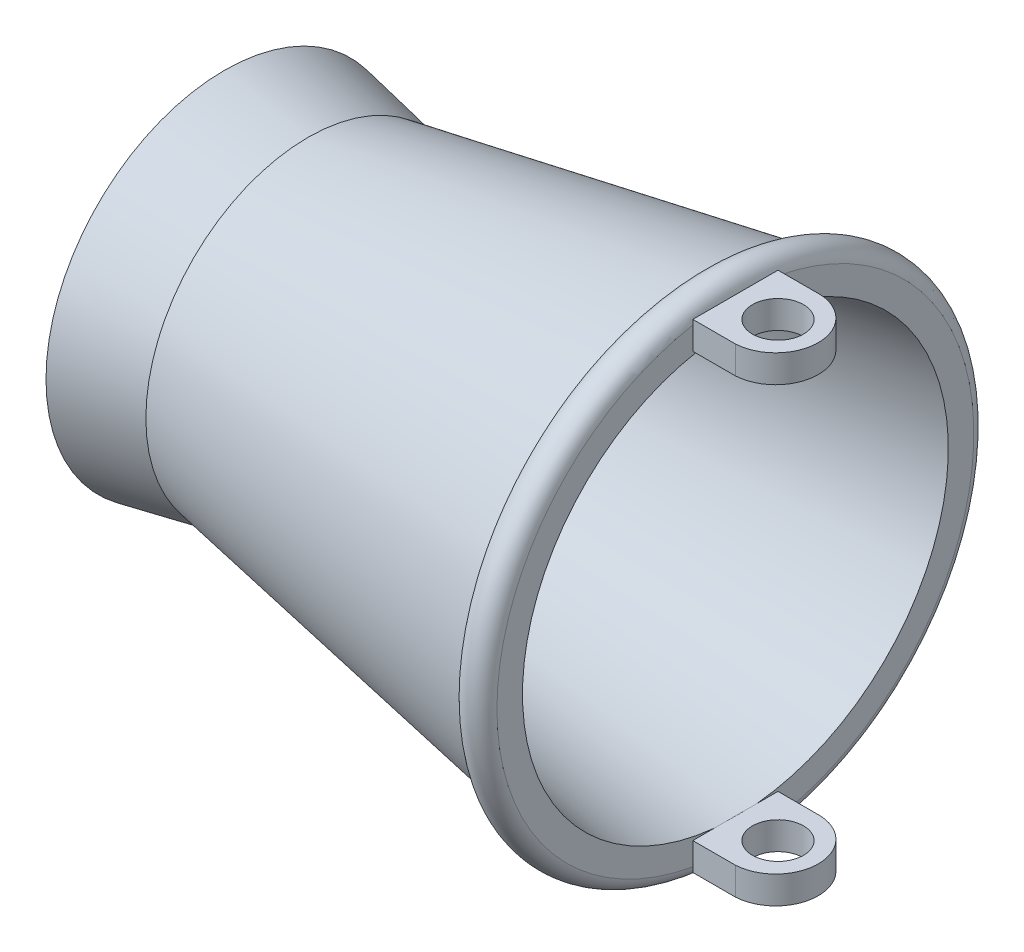
ISO-10303-21;
HEADER;
FILE_DESCRIPTION(('STEP AP214'),'2;1');
FILE_NAME('part.step','',(''),(''),'','','');
FILE_SCHEMA(('AUTOMOTIVE_DESIGN { 1 0 10303 214 1 1 1 1 }'));
ENDSEC;
DATA;
#1=APPLICATION_CONTEXT('core data for automotive mechanical design processes');
#2=APPLICATION_PROTOCOL_DEFINITION('international standard','automotive_design',2000,#1);
#3=PRODUCT_CONTEXT('',#1,'mechanical');
#4=PRODUCT('Part','Part','',(#3));
#5=PRODUCT_RELATED_PRODUCT_CATEGORY('part','',(#4));
#6=PRODUCT_DEFINITION_FORMATION('','',#4);
#7=PRODUCT_DEFINITION_CONTEXT('part definition',#1,'design');
#8=PRODUCT_DEFINITION('design','',#6,#7);
#9=PRODUCT_DEFINITION_SHAPE('','',#8);
#10=(LENGTH_UNIT() NAMED_UNIT(*) SI_UNIT(.MILLI.,.METRE.));
#11=(NAMED_UNIT(*) PLANE_ANGLE_UNIT() SI_UNIT($,.RADIAN.));
#12=(NAMED_UNIT(*) SI_UNIT($,.STERADIAN.) SOLID_ANGLE_UNIT());
#13=UNCERTAINTY_MEASURE_WITH_UNIT(LENGTH_MEASURE(1.E-05),#10,'distance_accuracy_value','');
#14=(GEOMETRIC_REPRESENTATION_CONTEXT(3) GLOBAL_UNCERTAINTY_ASSIGNED_CONTEXT((#13)) GLOBAL_UNIT_ASSIGNED_CONTEXT((#10,
#11,#12)) REPRESENTATION_CONTEXT('',''));
#15=CARTESIAN_POINT('',(0.,0.,0.));
#16=DIRECTION('',(0.,0.,1.));
#17=DIRECTION('',(1.,0.,0.));
#18=AXIS2_PLACEMENT_3D('',#15,#16,#17);
#19=CARTESIAN_POINT('',(31.3496597971443,-14.0617621186695,2.50000000000001));
#20=DIRECTION('',(0.,0.,-1.));
#21=DIRECTION('',(-1.,0.,0.));
#22=AXIS2_PLACEMENT_3D('',#19,#20,#21);
#23=PLANE('',#22);
#24=DIRECTION('',(0.,-1.,0.));
#25=VECTOR('',#24,1.);
#26=CARTESIAN_POINT('',(28.8496597971443,18.0286817919166,2.5));
#27=LINE('',#26,#25);
#28=CARTESIAN_POINT('',(28.8496597971443,-12.4385118481672,2.5));
#29=VERTEX_POINT('',#28);
#30=CARTESIAN_POINT('',(28.8496597971443,-14.0617621186695,2.5));
#31=VERTEX_POINT('',#30);
#32=EDGE_CURVE('E124',#29,#31,#27,.T.);
#33=ORIENTED_EDGE('',*,*,#32,.F.);
#34=DIRECTION('',(-1.,0.,0.));
#35=VECTOR('',#34,1.);
#36=CARTESIAN_POINT('',(31.3496597971443,-12.4385118481672,2.50000000000001));
#37=LINE('',#36,#35);
#38=CARTESIAN_POINT('',(26.3496597971443,-12.4385118481672,2.50000000000001));
#39=VERTEX_POINT('',#38);
#40=EDGE_CURVE('E333',#29,#39,#37,.T.);
#41=ORIENTED_EDGE('',*,*,#40,.T.);
#42=DIRECTION('',(0.,-1.,0.));
#43=VECTOR('',#42,1.);
#44=CARTESIAN_POINT('',(26.3496597971443,-14.0617621186695,2.50000000000001));
#45=LINE('',#44,#43);
#46=CARTESIAN_POINT('',(26.3496597971443,-13.7749773139559,2.50000000000001));
#47=VERTEX_POINT('',#46);
#48=EDGE_CURVE('E328',#39,#47,#45,.T.);
#49=ORIENTED_EDGE('',*,*,#48,.T.);
#50=CARTESIAN_POINT('',(26.3496597971443,-14.0617621186695,2.50000000000001));
#51=VERTEX_POINT('',#50);
#52=EDGE_CURVE('E142',#47,#51,#45,.T.);
#53=ORIENTED_EDGE('',*,*,#52,.T.);
#54=DIRECTION('',(-1.,0.,0.));
#55=VECTOR('',#54,1.);
#56=CARTESIAN_POINT('',(31.3496597971443,-14.0617621186695,2.50000000000001));
#57=LINE('',#56,#55);
#58=EDGE_CURVE('E137',#31,#51,#57,.T.);
#59=ORIENTED_EDGE('',*,*,#58,.F.);
#60=EDGE_LOOP('',(#33,#41,#49,#53,#59));
#61=FACE_BOUND('',#60,.T.);
#62=ADVANCED_FACE('F38',(#61),#23,.F.);
#63=CARTESIAN_POINT('',(31.3496597971443,-14.0617621186695,2.50000000000001));
#64=DIRECTION('',(0.,1.,0.));
#65=DIRECTION('',(0.,0.,1.));
#66=AXIS2_PLACEMENT_3D('',#63,#64,#65);
#67=PLANE('',#66);
#68=CARTESIAN_POINT('',(28.8496597971443,-14.0617621186695,0.));
#69=DIRECTION('',(0.,1.,0.));
#70=DIRECTION('',(0.,0.,1.));
#71=AXIS2_PLACEMENT_3D('',#68,#69,#70);
#72=CIRCLE('',#71,1.5);
#73=CARTESIAN_POINT('',(28.8496597971443,-14.0617621186695,1.5));
#74=VERTEX_POINT('',#73);
#75=EDGE_CURVE('E348',#74,#74,#72,.T.);
#76=ORIENTED_EDGE('',*,*,#75,.T.);
#77=EDGE_LOOP('',(#76));
#78=FACE_BOUND('',#77,.T.);
#79=CARTESIAN_POINT('',(28.7134886019713,-14.0617621186695,0.));
#80=DIRECTION('',(0.,-1.,0.));
#81=DIRECTION('',(0.,0.,-1.));
#82=AXIS2_PLACEMENT_3D('',#79,#80,#81);
#83=CIRCLE('',#82,2.50370577232926);
#84=CARTESIAN_POINT('',(28.8496597971443,-14.0617621186695,-2.5));
#85=VERTEX_POINT('',#84);
#86=EDGE_CURVE('E127',#85,#31,#83,.T.);
#87=ORIENTED_EDGE('',*,*,#86,.T.);
#88=ORIENTED_EDGE('',*,*,#58,.T.);
#89=DIRECTION('',(0.,0.,-1.));
#90=VECTOR('',#89,1.);
#91=CARTESIAN_POINT('',(26.3496597971443,-14.0617621186695,2.50000000000001));
#92=LINE('',#91,#90);
#93=CARTESIAN_POINT('',(26.3496597971443,-14.0617621186695,-2.49999999999998));
#94=VERTEX_POINT('',#93);
#95=EDGE_CURVE('E290',#51,#94,#92,.T.);
#96=ORIENTED_EDGE('',*,*,#95,.T.);
#97=DIRECTION('',(-1.,0.,0.));
#98=VECTOR('',#97,1.);
#99=CARTESIAN_POINT('',(31.3496597971443,-14.0617621186695,-2.49999999999998));
#100=LINE('',#99,#98);
#101=EDGE_CURVE('E139',#85,#94,#100,.T.);
#102=ORIENTED_EDGE('',*,*,#101,.F.);
#103=EDGE_LOOP('',(#87,#88,#96,#102));
#104=FACE_BOUND('',#103,.T.);
#105=ADVANCED_FACE('F135',(#78,#104),#67,.F.);
#106=CARTESIAN_POINT('',(31.3496597971443,-14.0617621186695,-2.49999999999998));
#107=DIRECTION('',(0.,0.,1.));
#108=DIRECTION('',(0.,-1.,0.));
#109=AXIS2_PLACEMENT_3D('',#106,#107,#108);
#110=PLANE('',#109);
#111=DIRECTION('',(0.,-1.,0.));
#112=VECTOR('',#111,1.);
#113=CARTESIAN_POINT('',(28.8496597971443,18.0286817919166,-2.5));
#114=LINE('',#113,#112);
#115=CARTESIAN_POINT('',(28.8496597971443,-12.4385118481672,-2.49999999999999));
#116=VERTEX_POINT('',#115);
#117=EDGE_CURVE('E52',#116,#85,#114,.T.);
#118=ORIENTED_EDGE('',*,*,#117,.T.);
#119=ORIENTED_EDGE('',*,*,#101,.T.);
#120=DIRECTION('',(0.,1.,0.));
#121=VECTOR('',#120,1.);
#122=CARTESIAN_POINT('',(26.3496597971443,-14.0617621186695,-2.49999999999998));
#123=LINE('',#122,#121);
#124=CARTESIAN_POINT('',(26.3496597971443,-13.7749773139559,-2.49999999999999));
#125=VERTEX_POINT('',#124);
#126=EDGE_CURVE('E289',#94,#125,#123,.T.);
#127=ORIENTED_EDGE('',*,*,#126,.T.);
#128=CARTESIAN_POINT('',(26.3496597971443,-12.4385118481672,-2.49999999999999));
#129=VERTEX_POINT('',#128);
#130=EDGE_CURVE('E280',#125,#129,#123,.T.);
#131=ORIENTED_EDGE('',*,*,#130,.T.);
#132=DIRECTION('',(-1.,0.,0.));
#133=VECTOR('',#132,1.);
#134=CARTESIAN_POINT('',(31.3496597971443,-12.4385118481672,-2.49999999999999));
#135=LINE('',#134,#133);
#136=EDGE_CURVE('E149',#116,#129,#135,.T.);
#137=ORIENTED_EDGE('',*,*,#136,.F.);
#138=EDGE_LOOP('',(#118,#119,#127,#131,#137));
#139=FACE_BOUND('',#138,.T.);
#140=ADVANCED_FACE('F219',(#139),#110,.F.);
#141=CARTESIAN_POINT('',(31.3496597971443,-12.4385118481672,2.50000000000001));
#142=DIRECTION('',(0.,-1.,0.));
#143=DIRECTION('',(0.,0.,-1.));
#144=AXIS2_PLACEMENT_3D('',#141,#142,#143);
#145=PLANE('',#144);
#146=CARTESIAN_POINT('',(28.8496597971443,-12.4385118481672,0.));
#147=DIRECTION('',(0.,-1.,0.));
#148=DIRECTION('',(0.,0.,-1.));
#149=AXIS2_PLACEMENT_3D('',#146,#147,#148);
#150=CIRCLE('',#149,1.5);
#151=CARTESIAN_POINT('',(28.8496597971443,-12.4385118481672,-1.5));
#152=VERTEX_POINT('',#151);
#153=EDGE_CURVE('E345',#152,#152,#150,.F.);
#154=ORIENTED_EDGE('',*,*,#153,.F.);
#155=EDGE_LOOP('',(#154));
#156=FACE_BOUND('',#155,.T.);
#157=CARTESIAN_POINT('',(28.7134886019713,-12.4385118481672,0.));
#158=DIRECTION('',(0.,-1.,0.));
#159=DIRECTION('',(0.,0.,-1.));
#160=AXIS2_PLACEMENT_3D('',#157,#158,#159);
#161=CIRCLE('',#160,2.50370577232926);
#162=EDGE_CURVE('E11',#116,#29,#161,.T.);
#163=ORIENTED_EDGE('',*,*,#162,.F.);
#164=ORIENTED_EDGE('',*,*,#136,.T.);
#165=DIRECTION('',(0.,0.,1.));
#166=VECTOR('',#165,1.);
#167=CARTESIAN_POINT('',(26.3496597971443,-12.4385118481672,2.50000000000001));
#168=LINE('',#167,#166);
#169=CARTESIAN_POINT('',(26.3496597971443,-12.4385118481672,-1.23831458160073));
#170=VERTEX_POINT('',#169);
#171=EDGE_CURVE('E285',#129,#170,#168,.T.);
#172=ORIENTED_EDGE('',*,*,#171,.T.);
#173=CARTESIAN_POINT('',(26.3496597971443,-12.4385118481672,1.23831458160074));
#174=VERTEX_POINT('',#173);
#175=EDGE_CURVE('E334',#170,#174,#168,.T.);
#176=ORIENTED_EDGE('',*,*,#175,.T.);
#177=EDGE_CURVE('E331',#174,#39,#168,.T.);
#178=ORIENTED_EDGE('',*,*,#177,.T.);
#179=ORIENTED_EDGE('',*,*,#40,.F.);
#180=EDGE_LOOP('',(#163,#164,#172,#176,#178,#179));
#181=FACE_BOUND('',#180,.T.);
#182=ADVANCED_FACE('F267',(#156,#181),#145,.F.);
#183=CARTESIAN_POINT('',(26.3496597971443,0.,-14.));
#184=DIRECTION('',(-1.,0.,0.));
#185=DIRECTION('',(0.,0.,1.));
#186=AXIS2_PLACEMENT_3D('',#183,#184,#185);
#187=PLANE('',#186);
#188=ORIENTED_EDGE('',*,*,#130,.F.);
#189=CARTESIAN_POINT('',(26.3496597971443,0.,0.));
#190=DIRECTION('',(-1.,0.,0.));
#191=DIRECTION('',(0.,0.,1.));
#192=AXIS2_PLACEMENT_3D('',#189,#190,#191);
#193=CIRCLE('',#192,14.);
#194=CARTESIAN_POINT('',(26.3496597971443,13.7749773139559,-2.5));
#195=VERTEX_POINT('',#194);
#196=EDGE_CURVE('E195',#195,#125,#193,.T.);
#197=ORIENTED_EDGE('',*,*,#196,.F.);
#198=DIRECTION('',(0.,1.,0.));
#199=VECTOR('',#198,1.);
#200=CARTESIAN_POINT('',(26.3496597971443,14.0617621186695,-2.5));
#201=LINE('',#200,#199);
#202=CARTESIAN_POINT('',(26.3496597971443,12.4385118481672,-2.5));
#203=VERTEX_POINT('',#202);
#204=EDGE_CURVE('E153',#203,#195,#201,.T.);
#205=ORIENTED_EDGE('',*,*,#204,.F.);
#206=DIRECTION('',(0.,0.,-1.));
#207=VECTOR('',#206,1.);
#208=CARTESIAN_POINT('',(26.3496597971443,12.4385118481672,2.5));
#209=LINE('',#208,#207);
#210=CARTESIAN_POINT('',(26.3496597971443,12.4385118481672,-1.23831458160075));
#211=VERTEX_POINT('',#210);
#212=EDGE_CURVE('E162',#211,#203,#209,.T.);
#213=ORIENTED_EDGE('',*,*,#212,.F.);
#214=CARTESIAN_POINT('',(26.3496597971443,0.,0.));
#215=DIRECTION('',(-1.,0.,0.));
#216=DIRECTION('',(0.,0.,1.));
#217=AXIS2_PLACEMENT_3D('',#214,#215,#216);
#218=CIRCLE('',#217,12.5);
#219=EDGE_CURVE('E197',#211,#170,#218,.T.);
#220=ORIENTED_EDGE('',*,*,#219,.T.);
#221=ORIENTED_EDGE('',*,*,#171,.F.);
#222=EDGE_LOOP('',(#188,#197,#205,#213,#220,#221));
#223=FACE_BOUND('',#222,.T.);
#224=ADVANCED_FACE('F265',(#223),#187,.F.);
#225=ORIENTED_EDGE('',*,*,#48,.F.);
#226=ORIENTED_EDGE('',*,*,#177,.F.);
#227=CARTESIAN_POINT('',(26.3496597971443,12.4385118481672,1.23831458160076));
#228=VERTEX_POINT('',#227);
#229=EDGE_CURVE('E194',#174,#228,#218,.T.);
#230=ORIENTED_EDGE('',*,*,#229,.T.);
#231=CARTESIAN_POINT('',(26.3496597971443,12.4385118481672,2.5));
#232=VERTEX_POINT('',#231);
#233=EDGE_CURVE('E163',#232,#228,#209,.T.);
#234=ORIENTED_EDGE('',*,*,#233,.F.);
#235=DIRECTION('',(0.,-1.,0.));
#236=VECTOR('',#235,1.);
#237=CARTESIAN_POINT('',(26.3496597971443,14.0617621186695,2.5));
#238=LINE('',#237,#236);
#239=CARTESIAN_POINT('',(26.3496597971443,13.7749773139559,2.5));
#240=VERTEX_POINT('',#239);
#241=EDGE_CURVE('E158',#240,#232,#238,.T.);
#242=ORIENTED_EDGE('',*,*,#241,.F.);
#243=EDGE_CURVE('E190',#47,#240,#193,.T.);
#244=ORIENTED_EDGE('',*,*,#243,.F.);
#245=EDGE_LOOP('',(#225,#226,#230,#234,#242,#244));
#246=FACE_BOUND('',#245,.T.);
#247=ADVANCED_FACE('F212',(#246),#187,.F.);
#248=CARTESIAN_POINT('',(0.979732811363587,0.,-8.0625));
#249=DIRECTION('',(1.,0.,0.));
#250=DIRECTION('',(0.,0.,-1.));
#251=AXIS2_PLACEMENT_3D('',#248,#249,#250);
#252=PLANE('',#251);
#253=CARTESIAN_POINT('',(0.979732811363584,0.,0.));
#254=DIRECTION('',(-1.,0.,0.));
#255=DIRECTION('',(0.,0.,1.));
#256=AXIS2_PLACEMENT_3D('',#253,#254,#255);
#257=CIRCLE('',#256,8.0625);
#258=CARTESIAN_POINT('',(0.979732811363584,0.,8.0625));
#259=VERTEX_POINT('',#258);
#260=EDGE_CURVE('E175',#259,#259,#257,.T.);
#261=ORIENTED_EDGE('',*,*,#260,.T.);
#262=EDGE_LOOP('',(#261));
#263=FACE_BOUND('',#262,.T.);
#264=ADVANCED_FACE('F40',(#263),#252,.F.);
#265=CARTESIAN_POINT('',(2.47973281136359,0.,0.));
#266=DIRECTION('',(-1.,0.,0.));
#267=DIRECTION('',(0.,0.,1.));
#268=AXIS2_PLACEMENT_3D('',#265,#266,#267);
#269=PLANE('',#268);
#270=CARTESIAN_POINT('',(2.47973281136359,0.,0.));
#271=DIRECTION('',(-1.,0.,0.));
#272=DIRECTION('',(0.,0.,1.));
#273=AXIS2_PLACEMENT_3D('',#270,#271,#272);
#274=CIRCLE('',#273,8.64909564560414);
#275=CARTESIAN_POINT('',(2.47973281136359,0.,8.64909564560414));
#276=VERTEX_POINT('',#275);
#277=EDGE_CURVE('E46',#276,#276,#274,.T.);
#278=ORIENTED_EDGE('',*,*,#277,.F.);
#279=EDGE_LOOP('',(#278));
#280=FACE_BOUND('',#279,.T.);
#281=ADVANCED_FACE('F203',(#280),#269,.F.);
#282=CARTESIAN_POINT('',(2.47973281136359,0.,0.));
#283=DIRECTION('',(1.,0.,0.));
#284=DIRECTION('',(0.,0.,-1.));
#285=AXIS2_PLACEMENT_3D('',#282,#283,#284);
#286=CONICAL_SURFACE('',#285,8.64909564560414,0.15995052993475);
#287=EDGE_CURVE('E196',#228,#211,#218,.T.);
#288=ORIENTED_EDGE('',*,*,#287,.F.);
#289=ORIENTED_EDGE('',*,*,#229,.F.);
#290=CARTESIAN_POINT('',(26.3496597971443,0.,0.));
#291=DIRECTION('',(-1.,0.,0.));
#292=DIRECTION('',(0.,0.,1.));
#293=AXIS2_PLACEMENT_3D('',#290,#291,#292);
#294=CIRCLE('',#293,12.5);
#295=EDGE_CURVE('E144',#174,#170,#294,.F.);
#296=ORIENTED_EDGE('',*,*,#295,.T.);
#297=ORIENTED_EDGE('',*,*,#219,.F.);
#298=EDGE_LOOP('',(#288,#289,#296,#297));
#299=FACE_BOUND('',#298,.T.);
#300=ORIENTED_EDGE('',*,*,#277,.T.);
#301=EDGE_LOOP('',(#300));
#302=FACE_BOUND('',#301,.T.);
#303=ADVANCED_FACE('F201',(#299,#302),#286,.F.);
#304=CARTESIAN_POINT('',(25.3652344043891,0.,0.));
#305=DIRECTION('',(-1.,0.,0.));
#306=DIRECTION('',(0.,0.,1.));
#307=AXIS2_PLACEMENT_3D('',#304,#305,#306);
#308=TOROIDAL_SURFACE('',#307,13.8241971385363,1.);
#309=CARTESIAN_POINT('',(24.380809011634,0.,0.));
#310=DIRECTION('',(-1.,0.,0.));
#311=DIRECTION('',(0.,0.,1.));
#312=AXIS2_PLACEMENT_3D('',#309,#310,#311);
#313=CIRCLE('',#312,13.6483942770726);
#314=CARTESIAN_POINT('',(24.380809011634,0.,13.6483942770726));
#315=VERTEX_POINT('',#314);
#316=EDGE_CURVE('E187',#315,#315,#313,.T.);
#317=ORIENTED_EDGE('',*,*,#316,.F.);
#318=EDGE_LOOP('',(#317));
#319=FACE_BOUND('',#318,.T.);
#320=EDGE_CURVE('E191',#240,#195,#193,.T.);
#321=ORIENTED_EDGE('',*,*,#320,.T.);
#322=ORIENTED_EDGE('',*,*,#196,.T.);
#323=EDGE_CURVE('E294',#125,#47,#193,.T.);
#324=ORIENTED_EDGE('',*,*,#323,.T.);
#325=ORIENTED_EDGE('',*,*,#243,.T.);
#326=EDGE_LOOP('',(#321,#322,#324,#325));
#327=FACE_BOUND('',#326,.T.);
#328=ADVANCED_FACE('F209',(#319,#327),#308,.T.);
#329=CARTESIAN_POINT('',(24.380809011634,0.,0.));
#330=DIRECTION('',(1.,0.,0.));
#331=DIRECTION('',(0.,0.,-1.));
#332=AXIS2_PLACEMENT_3D('',#329,#330,#331);
#333=CONICAL_SURFACE('',#332,13.6483942770726,0.176721272416258);
#334=CARTESIAN_POINT('',(1.25772251541693,0.,0.));
#335=DIRECTION('',(-1.,0.,0.));
#336=DIRECTION('',(0.,0.,1.));
#337=AXIS2_PLACEMENT_3D('',#334,#335,#336);
#338=CIRCLE('',#337,9.51897542844793);
#339=CARTESIAN_POINT('',(1.25772251541693,0.,9.51897542844793));
#340=VERTEX_POINT('',#339);
#341=EDGE_CURVE('E184',#340,#340,#338,.T.);
#342=ORIENTED_EDGE('',*,*,#341,.F.);
#343=EDGE_LOOP('',(#342));
#344=FACE_BOUND('',#343,.T.);
#345=ORIENTED_EDGE('',*,*,#316,.T.);
#346=EDGE_LOOP('',(#345));
#347=FACE_BOUND('',#346,.T.);
#348=ADVANCED_FACE('F257',(#344,#347),#333,.T.);
#349=CARTESIAN_POINT('',(1.25772251541693,0.,0.));
#350=DIRECTION('',(-1.,0.,0.));
#351=DIRECTION('',(0.,0.,1.));
#352=AXIS2_PLACEMENT_3D('',#349,#350,#351);
#353=CONICAL_SURFACE('',#352,9.51897542844793,0.192062927441525);
#354=CARTESIAN_POINT('',(-3.6503402028557,0.,0.));
#355=DIRECTION('',(-1.,0.,0.));
#356=DIRECTION('',(0.,0.,1.));
#357=AXIS2_PLACEMENT_3D('',#354,#355,#356);
#358=CIRCLE('',#357,10.4733969042658);
#359=CARTESIAN_POINT('',(-3.6503402028557,0.,10.4733969042658));
#360=VERTEX_POINT('',#359);
#361=EDGE_CURVE('E181',#360,#360,#358,.T.);
#362=ORIENTED_EDGE('',*,*,#361,.F.);
#363=EDGE_LOOP('',(#362));
#364=FACE_BOUND('',#363,.T.);
#365=ORIENTED_EDGE('',*,*,#341,.T.);
#366=EDGE_LOOP('',(#365));
#367=FACE_BOUND('',#366,.T.);
#368=ADVANCED_FACE('F253',(#364,#367),#353,.T.);
#369=CARTESIAN_POINT('',(-3.6503402028557,0.,0.));
#370=DIRECTION('',(1.,0.,0.));
#371=DIRECTION('',(0.,0.,-1.));
#372=AXIS2_PLACEMENT_3D('',#369,#370,#371);
#373=CONICAL_SURFACE('',#372,10.4733969042658,1.38217994061949);
#374=CARTESIAN_POINT('',(-3.9315902028557,0.,0.));
#375=DIRECTION('',(-1.,0.,0.));
#376=DIRECTION('',(0.,0.,1.));
#377=AXIS2_PLACEMENT_3D('',#374,#375,#376);
#378=CIRCLE('',#377,9.);
#379=CARTESIAN_POINT('',(-3.9315902028557,0.,9.));
#380=VERTEX_POINT('',#379);
#381=EDGE_CURVE('E178',#380,#380,#378,.T.);
#382=ORIENTED_EDGE('',*,*,#381,.F.);
#383=EDGE_LOOP('',(#382));
#384=FACE_BOUND('',#383,.T.);
#385=ORIENTED_EDGE('',*,*,#361,.T.);
#386=EDGE_LOOP('',(#385));
#387=FACE_BOUND('',#386,.T.);
#388=ADVANCED_FACE('F249',(#384,#387),#373,.T.);
#389=CARTESIAN_POINT('',(-3.9315902028557,0.,0.));
#390=DIRECTION('',(-1.,0.,0.));
#391=DIRECTION('',(0.,0.,1.));
#392=AXIS2_PLACEMENT_3D('',#389,#390,#391);
#393=CONICAL_SURFACE('',#392,9.,0.188616386175404);
#394=ORIENTED_EDGE('',*,*,#260,.F.);
#395=EDGE_LOOP('',(#394));
#396=FACE_BOUND('',#395,.T.);
#397=ORIENTED_EDGE('',*,*,#381,.T.);
#398=EDGE_LOOP('',(#397));
#399=FACE_BOUND('',#398,.T.);
#400=ADVANCED_FACE('F246',(#396,#399),#393,.F.);
#401=CARTESIAN_POINT('',(26.3496597971443,0.,0.));
#402=DIRECTION('',(1.,0.,0.));
#403=DIRECTION('',(0.,0.,-1.));
#404=AXIS2_PLACEMENT_3D('',#401,#402,#403);
#405=PLANE('',#404);
#406=EDGE_CURVE('E167',#228,#211,#209,.T.);
#407=ORIENTED_EDGE('',*,*,#406,.F.);
#408=ORIENTED_EDGE('',*,*,#287,.T.);
#409=EDGE_LOOP('',(#407,#408));
#410=FACE_BOUND('',#409,.T.);
#411=ADVANCED_FACE('F230',(#410),#405,.F.);
#412=CARTESIAN_POINT('',(31.3496597971443,14.0617621186695,-2.5));
#413=DIRECTION('',(0.,0.,1.));
#414=DIRECTION('',(0.,-1.,0.));
#415=AXIS2_PLACEMENT_3D('',#412,#413,#414);
#416=PLANE('',#415);
#417=DIRECTION('',(-1.,0.,0.));
#418=VECTOR('',#417,1.);
#419=CARTESIAN_POINT('',(31.3496597971443,14.0617621186695,-2.5));
#420=LINE('',#419,#418);
#421=CARTESIAN_POINT('',(28.8496597971443,14.0617621186695,-2.5));
#422=VERTEX_POINT('',#421);
#423=CARTESIAN_POINT('',(26.3496597971443,14.0617621186695,-2.5));
#424=VERTEX_POINT('',#423);
#425=EDGE_CURVE('E173',#422,#424,#420,.T.);
#426=ORIENTED_EDGE('',*,*,#425,.F.);
#427=DIRECTION('',(0.,1.,0.));
#428=VECTOR('',#427,1.);
#429=CARTESIAN_POINT('',(28.8496597971443,6.84834190441769,-2.5));
#430=LINE('',#429,#428);
#431=CARTESIAN_POINT('',(28.8496597971443,12.4385118481672,-2.5));
#432=VERTEX_POINT('',#431);
#433=EDGE_CURVE('E320',#432,#422,#430,.T.);
#434=ORIENTED_EDGE('',*,*,#433,.F.);
#435=DIRECTION('',(-1.,0.,0.));
#436=VECTOR('',#435,1.);
#437=CARTESIAN_POINT('',(31.3496597971443,12.4385118481672,-2.5));
#438=LINE('',#437,#436);
#439=EDGE_CURVE('E166',#432,#203,#438,.T.);
#440=ORIENTED_EDGE('',*,*,#439,.T.);
#441=ORIENTED_EDGE('',*,*,#204,.T.);
#442=EDGE_CURVE('E147',#195,#424,#201,.T.);
#443=ORIENTED_EDGE('',*,*,#442,.T.);
#444=EDGE_LOOP('',(#426,#434,#440,#441,#443));
#445=FACE_BOUND('',#444,.T.);
#446=ADVANCED_FACE('F241',(#445),#416,.F.);
#447=CARTESIAN_POINT('',(31.3496597971443,14.0617621186695,2.5));
#448=DIRECTION('',(0.,-1.,0.));
#449=DIRECTION('',(0.,0.,-1.));
#450=AXIS2_PLACEMENT_3D('',#447,#448,#449);
#451=PLANE('',#450);
#452=CARTESIAN_POINT('',(28.8496597971443,14.0617621186695,0.));
#453=DIRECTION('',(0.,1.,0.));
#454=DIRECTION('',(0.,0.,1.));
#455=AXIS2_PLACEMENT_3D('',#452,#453,#454);
#456=CIRCLE('',#455,1.5);
#457=CARTESIAN_POINT('',(28.8496597971443,14.0617621186695,1.5));
#458=VERTEX_POINT('',#457);
#459=EDGE_CURVE('E340',#458,#458,#456,.T.);
#460=ORIENTED_EDGE('',*,*,#459,.F.);
#461=EDGE_LOOP('',(#460));
#462=FACE_BOUND('',#461,.T.);
#463=DIRECTION('',(-1.,0.,0.));
#464=VECTOR('',#463,1.);
#465=CARTESIAN_POINT('',(31.3496597971443,14.0617621186695,2.5));
#466=LINE('',#465,#464);
#467=CARTESIAN_POINT('',(28.8496597971443,14.0617621186695,2.5));
#468=VERTEX_POINT('',#467);
#469=CARTESIAN_POINT('',(26.3496597971443,14.0617621186695,2.5));
#470=VERTEX_POINT('',#469);
#471=EDGE_CURVE('E171',#468,#470,#466,.T.);
#472=ORIENTED_EDGE('',*,*,#471,.F.);
#473=CARTESIAN_POINT('',(28.7134886019713,14.0617621186695,0.));
#474=DIRECTION('',(0.,-1.,0.));
#475=DIRECTION('',(0.,0.,-1.));
#476=AXIS2_PLACEMENT_3D('',#473,#474,#475);
#477=CIRCLE('',#476,2.50370577232926);
#478=EDGE_CURVE('E131',#422,#468,#477,.T.);
#479=ORIENTED_EDGE('',*,*,#478,.F.);
#480=ORIENTED_EDGE('',*,*,#425,.T.);
#481=DIRECTION('',(0.,0.,1.));
#482=VECTOR('',#481,1.);
#483=CARTESIAN_POINT('',(26.3496597971443,14.0617621186695,2.5));
#484=LINE('',#483,#482);
#485=EDGE_CURVE('E155',#424,#470,#484,.T.);
#486=ORIENTED_EDGE('',*,*,#485,.T.);
#487=EDGE_LOOP('',(#472,#479,#480,#486));
#488=FACE_BOUND('',#487,.T.);
#489=ADVANCED_FACE('F237',(#462,#488),#451,.F.);
#490=CARTESIAN_POINT('',(31.3496597971443,14.0617621186695,2.5));
#491=DIRECTION('',(0.,0.,-1.));
#492=DIRECTION('',(-1.,0.,0.));
#493=AXIS2_PLACEMENT_3D('',#490,#491,#492);
#494=PLANE('',#493);
#495=DIRECTION('',(-1.,0.,0.));
#496=VECTOR('',#495,1.);
#497=CARTESIAN_POINT('',(31.3496597971443,12.4385118481672,2.5));
#498=LINE('',#497,#496);
#499=CARTESIAN_POINT('',(28.8496597971443,12.4385118481672,2.5));
#500=VERTEX_POINT('',#499);
#501=EDGE_CURVE('E169',#500,#232,#498,.T.);
#502=ORIENTED_EDGE('',*,*,#501,.F.);
#503=DIRECTION('',(0.,1.,0.));
#504=VECTOR('',#503,1.);
#505=CARTESIAN_POINT('',(28.8496597971443,6.84834190441769,2.5));
#506=LINE('',#505,#504);
#507=EDGE_CURVE('E60',#500,#468,#506,.T.);
#508=ORIENTED_EDGE('',*,*,#507,.T.);
#509=ORIENTED_EDGE('',*,*,#471,.T.);
#510=EDGE_CURVE('E159',#470,#240,#238,.T.);
#511=ORIENTED_EDGE('',*,*,#510,.T.);
#512=ORIENTED_EDGE('',*,*,#241,.T.);
#513=EDGE_LOOP('',(#502,#508,#509,#511,#512));
#514=FACE_BOUND('',#513,.T.);
#515=ADVANCED_FACE('F233',(#514),#494,.F.);
#516=CARTESIAN_POINT('',(31.3496597971443,12.4385118481672,2.5));
#517=DIRECTION('',(0.,1.,0.));
#518=DIRECTION('',(0.,0.,1.));
#519=AXIS2_PLACEMENT_3D('',#516,#517,#518);
#520=PLANE('',#519);
#521=CARTESIAN_POINT('',(28.8496597971443,12.4385118481672,0.));
#522=DIRECTION('',(0.,1.,0.));
#523=DIRECTION('',(0.,0.,1.));
#524=AXIS2_PLACEMENT_3D('',#521,#522,#523);
#525=CIRCLE('',#524,1.5);
#526=CARTESIAN_POINT('',(28.8496597971443,12.4385118481672,1.5));
#527=VERTEX_POINT('',#526);
#528=EDGE_CURVE('E337',#527,#527,#525,.F.);
#529=ORIENTED_EDGE('',*,*,#528,.F.);
#530=EDGE_LOOP('',(#529));
#531=FACE_BOUND('',#530,.T.);
#532=ORIENTED_EDGE('',*,*,#439,.F.);
#533=CARTESIAN_POINT('',(28.7134886019713,12.4385118481672,0.));
#534=DIRECTION('',(0.,1.,0.));
#535=DIRECTION('',(0.,0.,1.));
#536=AXIS2_PLACEMENT_3D('',#533,#534,#535);
#537=CIRCLE('',#536,2.50370577232926);
#538=EDGE_CURVE('E322',#500,#432,#537,.T.);
#539=ORIENTED_EDGE('',*,*,#538,.F.);
#540=ORIENTED_EDGE('',*,*,#501,.T.);
#541=ORIENTED_EDGE('',*,*,#233,.T.);
#542=ORIENTED_EDGE('',*,*,#406,.T.);
#543=ORIENTED_EDGE('',*,*,#212,.T.);
#544=EDGE_LOOP('',(#532,#539,#540,#541,#542,#543));
#545=FACE_BOUND('',#544,.T.);
#546=ADVANCED_FACE('F228',(#531,#545),#520,.F.);
#547=ORIENTED_EDGE('',*,*,#442,.F.);
#548=ORIENTED_EDGE('',*,*,#320,.F.);
#549=ORIENTED_EDGE('',*,*,#510,.F.);
#550=ORIENTED_EDGE('',*,*,#485,.F.);
#551=EDGE_LOOP('',(#547,#548,#549,#550));
#552=FACE_BOUND('',#551,.T.);
#553=ADVANCED_FACE('F224',(#552),#405,.F.);
#554=CARTESIAN_POINT('',(26.3496597971443,0.,0.));
#555=DIRECTION('',(-1.,0.,0.));
#556=DIRECTION('',(0.,0.,1.));
#557=AXIS2_PLACEMENT_3D('',#554,#555,#556);
#558=PLANE('',#557);
#559=ORIENTED_EDGE('',*,*,#295,.F.);
#560=ORIENTED_EDGE('',*,*,#175,.F.);
#561=EDGE_LOOP('',(#559,#560));
#562=FACE_BOUND('',#561,.T.);
#563=ADVANCED_FACE('F227',(#562),#558,.T.);
#564=ORIENTED_EDGE('',*,*,#323,.F.);
#565=ORIENTED_EDGE('',*,*,#126,.F.);
#566=ORIENTED_EDGE('',*,*,#95,.F.);
#567=ORIENTED_EDGE('',*,*,#52,.F.);
#568=EDGE_LOOP('',(#564,#565,#566,#567));
#569=FACE_BOUND('',#568,.T.);
#570=ADVANCED_FACE('F369',(#569),#558,.T.);
#571=CARTESIAN_POINT('',(28.7134886019713,6.84834190441769,0.));
#572=DIRECTION('',(0.,1.,0.));
#573=DIRECTION('',(0.,0.,1.));
#574=AXIS2_PLACEMENT_3D('',#571,#572,#573);
#575=CYLINDRICAL_SURFACE('',#574,2.50370577232926);
#576=ORIENTED_EDGE('',*,*,#538,.T.);
#577=ORIENTED_EDGE('',*,*,#433,.T.);
#578=ORIENTED_EDGE('',*,*,#478,.T.);
#579=ORIENTED_EDGE('',*,*,#507,.F.);
#580=EDGE_LOOP('',(#576,#577,#578,#579));
#581=FACE_BOUND('',#580,.T.);
#582=ADVANCED_FACE('F366',(#581),#575,.T.);
#583=CARTESIAN_POINT('',(28.7134886019713,18.0286817919166,0.));
#584=DIRECTION('',(0.,-1.,0.));
#585=DIRECTION('',(0.,0.,-1.));
#586=AXIS2_PLACEMENT_3D('',#583,#584,#585);
#587=CYLINDRICAL_SURFACE('',#586,2.50370577232926);
#588=ORIENTED_EDGE('',*,*,#162,.T.);
#589=ORIENTED_EDGE('',*,*,#32,.T.);
#590=ORIENTED_EDGE('',*,*,#86,.F.);
#591=ORIENTED_EDGE('',*,*,#117,.F.);
#592=EDGE_LOOP('',(#588,#589,#590,#591));
#593=FACE_BOUND('',#592,.T.);
#594=ADVANCED_FACE('F126',(#593),#587,.T.);
#595=CARTESIAN_POINT('',(28.8496597971443,8.19587116104788,0.));
#596=DIRECTION('',(0.,1.,0.));
#597=DIRECTION('',(0.,0.,1.));
#598=AXIS2_PLACEMENT_3D('',#595,#596,#597);
#599=CYLINDRICAL_SURFACE('',#598,1.5);
#600=ORIENTED_EDGE('',*,*,#528,.T.);
#601=EDGE_LOOP('',(#600));
#602=FACE_BOUND('',#601,.T.);
#603=ORIENTED_EDGE('',*,*,#459,.T.);
#604=EDGE_LOOP('',(#603));
#605=FACE_BOUND('',#604,.T.);
#606=ADVANCED_FACE('F355',(#602,#605),#599,.F.);
#607=CARTESIAN_POINT('',(28.8496597971443,16.6811525352865,0.));
#608=DIRECTION('',(0.,-1.,0.));
#609=DIRECTION('',(0.,0.,-1.));
#610=AXIS2_PLACEMENT_3D('',#607,#608,#609);
#611=CYLINDRICAL_SURFACE('',#610,1.5);
#612=ORIENTED_EDGE('',*,*,#75,.F.);
#613=EDGE_LOOP('',(#612));
#614=FACE_BOUND('',#613,.T.);
#615=ORIENTED_EDGE('',*,*,#153,.T.);
#616=EDGE_LOOP('',(#615));
#617=FACE_BOUND('',#616,.T.);
#618=ADVANCED_FACE('F352',(#614,#617),#611,.F.);
#619=CLOSED_SHELL('',(#62,#105,#140,#182,#224,#247,#264,#281,#303,#328,#348,#368,#388,#400,#411,
#446,#489,#515,#546,#553,#563,#570,#582,#594,#606,#618));
#620=MANIFOLD_SOLID_BREP('B2',#619);
#621=ADVANCED_BREP_SHAPE_REPRESENTATION('',(#18,#620),#14);
#622=SHAPE_DEFINITION_REPRESENTATION(#9,#621);
ENDSEC;
END-ISO-10303-21;
